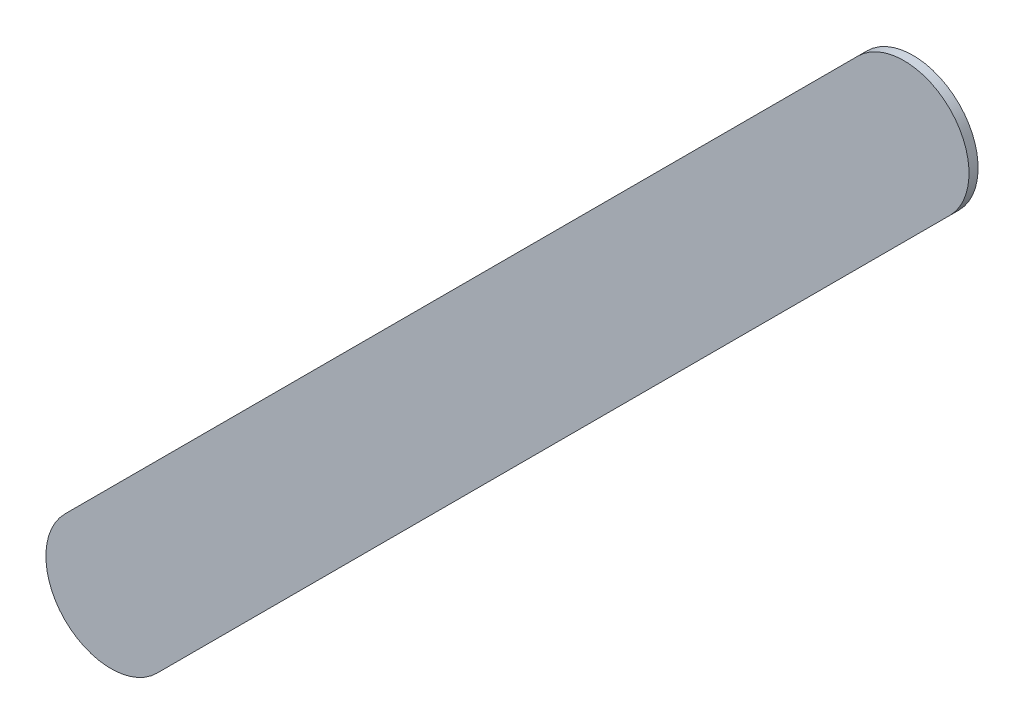
ISO-10303-21;
HEADER;
FILE_DESCRIPTION(('STEP AP214'),'2;1');
FILE_NAME('part.step','',(''),(''),'','','');
FILE_SCHEMA(('AUTOMOTIVE_DESIGN { 1 0 10303 214 1 1 1 1 }'));
ENDSEC;
DATA;
#1=APPLICATION_CONTEXT('core data for automotive mechanical design processes');
#2=APPLICATION_PROTOCOL_DEFINITION('international standard','automotive_design',2000,#1);
#3=PRODUCT_CONTEXT('',#1,'mechanical');
#4=PRODUCT('Part','Part','',(#3));
#5=PRODUCT_RELATED_PRODUCT_CATEGORY('part','',(#4));
#6=PRODUCT_DEFINITION_FORMATION('','',#4);
#7=PRODUCT_DEFINITION_CONTEXT('part definition',#1,'design');
#8=PRODUCT_DEFINITION('design','',#6,#7);
#9=PRODUCT_DEFINITION_SHAPE('','',#8);
#10=(LENGTH_UNIT() NAMED_UNIT(*) SI_UNIT(.MILLI.,.METRE.));
#11=(NAMED_UNIT(*) PLANE_ANGLE_UNIT() SI_UNIT($,.RADIAN.));
#12=(NAMED_UNIT(*) SI_UNIT($,.STERADIAN.) SOLID_ANGLE_UNIT());
#13=UNCERTAINTY_MEASURE_WITH_UNIT(LENGTH_MEASURE(1.E-05),#10,'distance_accuracy_value','');
#14=(GEOMETRIC_REPRESENTATION_CONTEXT(3) GLOBAL_UNCERTAINTY_ASSIGNED_CONTEXT((#13)) GLOBAL_UNIT_ASSIGNED_CONTEXT((#10,
#11,#12)) REPRESENTATION_CONTEXT('',''));
#15=CARTESIAN_POINT('',(0.,0.,0.));
#16=DIRECTION('',(0.,0.,1.));
#17=DIRECTION('',(1.,0.,0.));
#18=AXIS2_PLACEMENT_3D('',#15,#16,#17);
#19=CARTESIAN_POINT('',(152.731223,-76.023223,0.));
#20=DIRECTION('',(0.,0.,1.));
#21=DIRECTION('',(1.,0.,0.));
#22=AXIS2_PLACEMENT_3D('',#19,#20,#21);
#23=PLANE('',#22);
#24=DIRECTION('',(-0.707106781186548,-0.707106781186548,0.));
#25=VECTOR('',#24,1.);
#26=CARTESIAN_POINT('',(152.731223,-76.023223,0.));
#27=LINE('',#26,#25);
#28=CARTESIAN_POINT('',(152.731223,-76.023223,0.));
#29=VERTEX_POINT('',#28);
#30=CARTESIAN_POINT('',(149.683223,-79.071223,0.));
#31=VERTEX_POINT('',#30);
#32=EDGE_CURVE('E70',#29,#31,#27,.T.);
#33=ORIENTED_EDGE('',*,*,#32,.T.);
#34=CARTESIAN_POINT('',(149.8599995,-79.2479995,0.));
#35=DIRECTION('',(0.,0.,1.));
#36=DIRECTION('',(-0.707106781187048,0.707106781186048,0.));
#37=AXIS2_PLACEMENT_3D('',#34,#35,#36);
#38=CIRCLE('',#37,0.249999723809);
#39=CARTESIAN_POINT('',(150.036776,-79.424776,0.));
#40=VERTEX_POINT('',#39);
#41=EDGE_CURVE('E101',#31,#40,#38,.T.);
#42=ORIENTED_EDGE('',*,*,#41,.T.);
#43=DIRECTION('',(0.707106781186548,0.707106781186548,0.));
#44=VECTOR('',#43,1.);
#45=CARTESIAN_POINT('',(150.036776,-79.424776,0.));
#46=LINE('',#45,#44);
#47=CARTESIAN_POINT('',(153.084776,-76.376776,0.));
#48=VERTEX_POINT('',#47);
#49=EDGE_CURVE('E72',#40,#48,#46,.T.);
#50=ORIENTED_EDGE('',*,*,#49,.T.);
#51=CARTESIAN_POINT('',(152.9079995,-76.1999995,0.));
#52=DIRECTION('',(0.,0.,1.));
#53=DIRECTION('',(0.707106781186548,-0.707106781186548,0.));
#54=AXIS2_PLACEMENT_3D('',#51,#52,#53);
#55=CIRCLE('',#54,0.249999723809);
#56=EDGE_CURVE('E11',#48,#29,#55,.T.);
#57=ORIENTED_EDGE('',*,*,#56,.T.);
#58=EDGE_LOOP('',(#33,#42,#50,#57));
#59=FACE_BOUND('',#58,.T.);
#60=ADVANCED_FACE('F17',(#59),#23,.T.);
#61=CARTESIAN_POINT('',(152.731223,-76.023223,-0.035));
#62=DIRECTION('',(0.,0.,1.));
#63=DIRECTION('',(1.,0.,0.));
#64=AXIS2_PLACEMENT_3D('',#61,#62,#63);
#65=PLANE('',#64);
#66=CARTESIAN_POINT('',(152.9079995,-76.1999995,-0.035));
#67=DIRECTION('',(0.,0.,1.));
#68=DIRECTION('',(0.707106781186548,-0.707106781186548,0.));
#69=AXIS2_PLACEMENT_3D('',#66,#67,#68);
#70=CIRCLE('',#69,0.249999723809);
#71=CARTESIAN_POINT('',(153.084776,-76.376776,-0.035));
#72=VERTEX_POINT('',#71);
#73=CARTESIAN_POINT('',(152.731223,-76.023223,-0.035));
#74=VERTEX_POINT('',#73);
#75=EDGE_CURVE('E25',#72,#74,#70,.T.);
#76=ORIENTED_EDGE('',*,*,#75,.F.);
#77=DIRECTION('',(0.707106781186548,0.707106781186548,0.));
#78=VECTOR('',#77,1.);
#79=CARTESIAN_POINT('',(150.036776,-79.424776,-0.035));
#80=LINE('',#79,#78);
#81=CARTESIAN_POINT('',(150.036776,-79.424776,-0.035));
#82=VERTEX_POINT('',#81);
#83=EDGE_CURVE('E94',#82,#72,#80,.T.);
#84=ORIENTED_EDGE('',*,*,#83,.F.);
#85=CARTESIAN_POINT('',(149.8599995,-79.2479995,-0.035));
#86=DIRECTION('',(0.,0.,1.));
#87=DIRECTION('',(-0.707106781187048,0.707106781186048,0.));
#88=AXIS2_PLACEMENT_3D('',#85,#86,#87);
#89=CIRCLE('',#88,0.249999723809);
#90=CARTESIAN_POINT('',(149.683223,-79.071223,-0.035));
#91=VERTEX_POINT('',#90);
#92=EDGE_CURVE('E80',#91,#82,#89,.T.);
#93=ORIENTED_EDGE('',*,*,#92,.F.);
#94=DIRECTION('',(-0.707106781186548,-0.707106781186548,0.));
#95=VECTOR('',#94,1.);
#96=CARTESIAN_POINT('',(152.731223,-76.023223,-0.035));
#97=LINE('',#96,#95);
#98=EDGE_CURVE('E91',#74,#91,#97,.T.);
#99=ORIENTED_EDGE('',*,*,#98,.F.);
#100=EDGE_LOOP('',(#76,#84,#93,#99));
#101=FACE_BOUND('',#100,.T.);
#102=ADVANCED_FACE('F118',(#101),#65,.F.);
#103=CARTESIAN_POINT('',(152.9079995,-76.1999995,-0.035));
#104=DIRECTION('',(0.,0.,-1.));
#105=DIRECTION('',(0.707106781186548,-0.707106781186548,0.));
#106=AXIS2_PLACEMENT_3D('',#103,#104,#105);
#107=CYLINDRICAL_SURFACE('',#106,0.249999723809);
#108=ORIENTED_EDGE('',*,*,#75,.T.);
#109=DIRECTION('',(0.,0.,1.));
#110=VECTOR('',#109,1.);
#111=CARTESIAN_POINT('',(152.731223,-76.023223,-0.035));
#112=LINE('',#111,#110);
#113=EDGE_CURVE('E75',#74,#29,#112,.T.);
#114=ORIENTED_EDGE('',*,*,#113,.T.);
#115=ORIENTED_EDGE('',*,*,#56,.F.);
#116=DIRECTION('',(0.,0.,1.));
#117=VECTOR('',#116,1.);
#118=CARTESIAN_POINT('',(153.084776,-76.376776,-0.035));
#119=LINE('',#118,#117);
#120=EDGE_CURVE('E106',#72,#48,#119,.T.);
#121=ORIENTED_EDGE('',*,*,#120,.F.);
#122=EDGE_LOOP('',(#108,#114,#115,#121));
#123=FACE_BOUND('',#122,.T.);
#124=ADVANCED_FACE('F76',(#123),#107,.T.);
#125=CARTESIAN_POINT('',(150.036776,-79.424776,-0.035));
#126=DIRECTION('',(-0.707106781186548,0.707106781186548,0.));
#127=DIRECTION('',(0.,0.,1.));
#128=AXIS2_PLACEMENT_3D('',#125,#126,#127);
#129=PLANE('',#128);
#130=ORIENTED_EDGE('',*,*,#83,.T.);
#131=ORIENTED_EDGE('',*,*,#120,.T.);
#132=ORIENTED_EDGE('',*,*,#49,.F.);
#133=DIRECTION('',(0.,0.,1.));
#134=VECTOR('',#133,1.);
#135=CARTESIAN_POINT('',(150.036776,-79.424776,-0.035));
#136=LINE('',#135,#134);
#137=EDGE_CURVE('E100',#82,#40,#136,.T.);
#138=ORIENTED_EDGE('',*,*,#137,.F.);
#139=EDGE_LOOP('',(#130,#131,#132,#138));
#140=FACE_BOUND('',#139,.T.);
#141=ADVANCED_FACE('F117',(#140),#129,.F.);
#142=CARTESIAN_POINT('',(149.8599995,-79.2479995,-0.035));
#143=DIRECTION('',(0.,0.,-1.));
#144=DIRECTION('',(-0.707106781187048,0.707106781186048,0.));
#145=AXIS2_PLACEMENT_3D('',#142,#143,#144);
#146=CYLINDRICAL_SURFACE('',#145,0.249999723809);
#147=ORIENTED_EDGE('',*,*,#92,.T.);
#148=ORIENTED_EDGE('',*,*,#137,.T.);
#149=ORIENTED_EDGE('',*,*,#41,.F.);
#150=DIRECTION('',(0.,0.,1.));
#151=VECTOR('',#150,1.);
#152=CARTESIAN_POINT('',(149.683223,-79.071223,-0.035));
#153=LINE('',#152,#151);
#154=EDGE_CURVE('E84',#91,#31,#153,.T.);
#155=ORIENTED_EDGE('',*,*,#154,.F.);
#156=EDGE_LOOP('',(#147,#148,#149,#155));
#157=FACE_BOUND('',#156,.T.);
#158=ADVANCED_FACE('F120',(#157),#146,.T.);
#159=CARTESIAN_POINT('',(152.731223,-76.023223,-0.035));
#160=DIRECTION('',(0.707106781186548,-0.707106781186548,0.));
#161=DIRECTION('',(0.,0.,-1.));
#162=AXIS2_PLACEMENT_3D('',#159,#160,#161);
#163=PLANE('',#162);
#164=ORIENTED_EDGE('',*,*,#98,.T.);
#165=ORIENTED_EDGE('',*,*,#154,.T.);
#166=ORIENTED_EDGE('',*,*,#32,.F.);
#167=ORIENTED_EDGE('',*,*,#113,.F.);
#168=EDGE_LOOP('',(#164,#165,#166,#167));
#169=FACE_BOUND('',#168,.T.);
#170=ADVANCED_FACE('F82',(#169),#163,.F.);
#171=CLOSED_SHELL('',(#60,#102,#124,#141,#158,#170));
#172=MANIFOLD_SOLID_BREP('B1',#171);
#173=ADVANCED_BREP_SHAPE_REPRESENTATION('',(#18,#172),#14);
#174=SHAPE_DEFINITION_REPRESENTATION(#9,#173);
ENDSEC;
END-ISO-10303-21;
